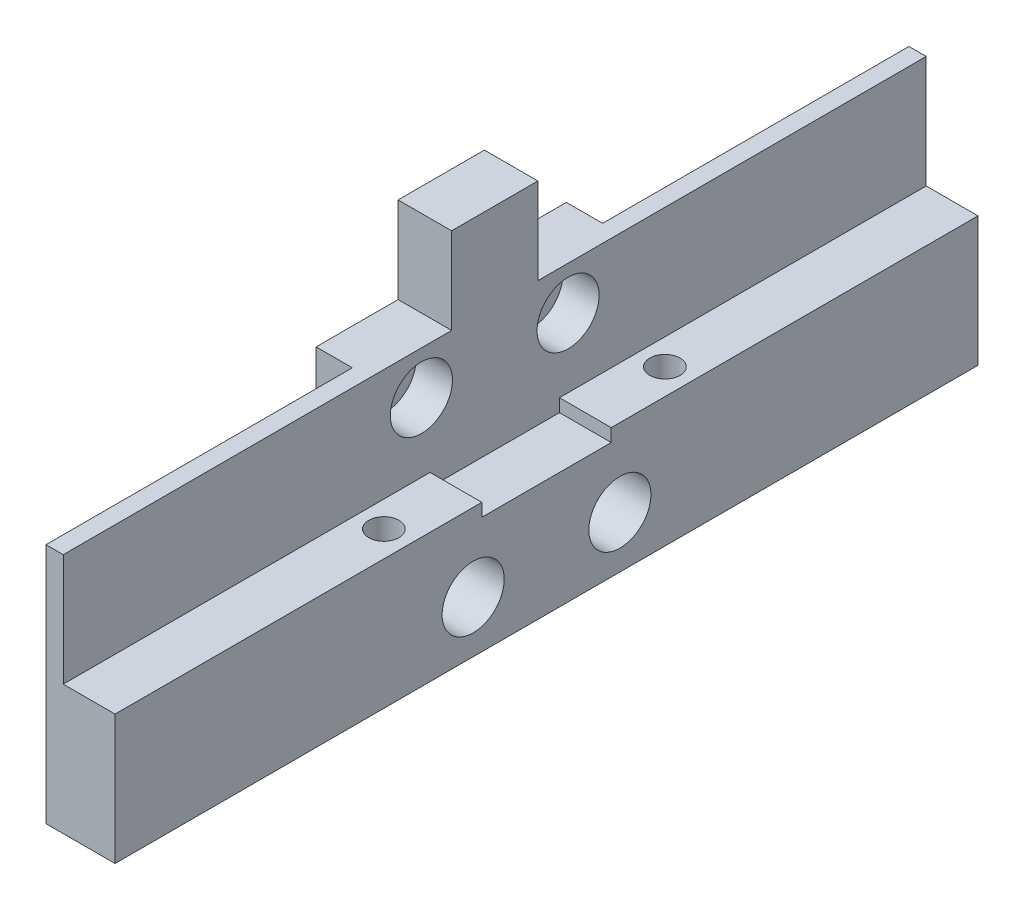
ISO-10303-21;
HEADER;
FILE_DESCRIPTION(('STEP AP214'),'2;1');
FILE_NAME('part.step','',(''),(''),'','','');
FILE_SCHEMA(('AUTOMOTIVE_DESIGN { 1 0 10303 214 1 1 1 1 }'));
ENDSEC;
DATA;
#1=APPLICATION_CONTEXT('core data for automotive mechanical design processes');
#2=APPLICATION_PROTOCOL_DEFINITION('international standard','automotive_design',2000,#1);
#3=PRODUCT_CONTEXT('',#1,'mechanical');
#4=PRODUCT('Part','Part','',(#3));
#5=PRODUCT_RELATED_PRODUCT_CATEGORY('part','',(#4));
#6=PRODUCT_DEFINITION_FORMATION('','',#4);
#7=PRODUCT_DEFINITION_CONTEXT('part definition',#1,'design');
#8=PRODUCT_DEFINITION('design','',#6,#7);
#9=PRODUCT_DEFINITION_SHAPE('','',#8);
#10=(LENGTH_UNIT() NAMED_UNIT(*) SI_UNIT(.MILLI.,.METRE.));
#11=(NAMED_UNIT(*) PLANE_ANGLE_UNIT() SI_UNIT($,.RADIAN.));
#12=(NAMED_UNIT(*) SI_UNIT($,.STERADIAN.) SOLID_ANGLE_UNIT());
#13=UNCERTAINTY_MEASURE_WITH_UNIT(LENGTH_MEASURE(1.E-05),#10,'distance_accuracy_value','');
#14=(GEOMETRIC_REPRESENTATION_CONTEXT(3) GLOBAL_UNCERTAINTY_ASSIGNED_CONTEXT((#13)) GLOBAL_UNIT_ASSIGNED_CONTEXT((#10,
#11,#12)) REPRESENTATION_CONTEXT('',''));
#15=CARTESIAN_POINT('',(0.,0.,0.));
#16=DIRECTION('',(0.,0.,1.));
#17=DIRECTION('',(1.,0.,0.));
#18=AXIS2_PLACEMENT_3D('',#15,#16,#17);
#19=CARTESIAN_POINT('',(6.,26.,-100.));
#20=DIRECTION('',(0.,1.,0.));
#21=DIRECTION('',(0.,0.,1.));
#22=AXIS2_PLACEMENT_3D('',#19,#20,#21);
#23=PLANE('',#22);
#24=DIRECTION('',(0.,0.,-1.));
#25=VECTOR('',#24,1.);
#26=CARTESIAN_POINT('',(14.2,26.,0.));
#27=LINE('',#26,#25);
#28=CARTESIAN_POINT('',(14.2,26.,0.));
#29=VERTEX_POINT('',#28);
#30=CARTESIAN_POINT('',(14.2,26.,-35.5));
#31=VERTEX_POINT('',#30);
#32=EDGE_CURVE('E231',#29,#31,#27,.T.);
#33=ORIENTED_EDGE('',*,*,#32,.F.);
#34=DIRECTION('',(1.,0.,0.));
#35=VECTOR('',#34,1.);
#36=CARTESIAN_POINT('',(6.,26.,0.));
#37=LINE('',#36,#35);
#38=CARTESIAN_POINT('',(16.2,26.,0.));
#39=VERTEX_POINT('',#38);
#40=EDGE_CURVE('E190',#29,#39,#37,.T.);
#41=ORIENTED_EDGE('',*,*,#40,.T.);
#42=DIRECTION('',(0.,0.,1.));
#43=VECTOR('',#42,1.);
#44=CARTESIAN_POINT('',(16.2,26.,-100.));
#45=LINE('',#44,#43);
#46=CARTESIAN_POINT('',(16.2,26.,-45.));
#47=VERTEX_POINT('',#46);
#48=EDGE_CURVE('E179',#47,#39,#45,.T.);
#49=ORIENTED_EDGE('',*,*,#48,.F.);
#50=DIRECTION('',(-1.,0.,0.));
#51=VECTOR('',#50,1.);
#52=CARTESIAN_POINT('',(30.3421356237309,26.,-45.));
#53=LINE('',#52,#51);
#54=CARTESIAN_POINT('',(10.,26.,-45.));
#55=VERTEX_POINT('',#54);
#56=EDGE_CURVE('E255',#47,#55,#53,.T.);
#57=ORIENTED_EDGE('',*,*,#56,.T.);
#58=DIRECTION('',(0.,0.,1.));
#59=VECTOR('',#58,1.);
#60=CARTESIAN_POINT('',(10.,26.,0.));
#61=LINE('',#60,#59);
#62=CARTESIAN_POINT('',(10.,26.,-35.5));
#63=VERTEX_POINT('',#62);
#64=EDGE_CURVE('E194',#55,#63,#61,.T.);
#65=ORIENTED_EDGE('',*,*,#64,.T.);
#66=DIRECTION('',(-1.,0.,0.));
#67=VECTOR('',#66,1.);
#68=CARTESIAN_POINT('',(14.2,26.,-35.5));
#69=LINE('',#68,#67);
#70=EDGE_CURVE('E230',#31,#63,#69,.T.);
#71=ORIENTED_EDGE('',*,*,#70,.F.);
#72=EDGE_LOOP('',(#33,#41,#49,#57,#65,#71));
#73=FACE_BOUND('',#72,.T.);
#74=ADVANCED_FACE('F36',(#73),#23,.T.);
#75=CARTESIAN_POINT('',(12.,0.,0.));
#76=DIRECTION('',(1.,0.,0.));
#77=DIRECTION('',(0.,0.,1.));
#78=AXIS2_PLACEMENT_3D('',#75,#76,#77);
#79=PLANE('',#78);
#80=CARTESIAN_POINT('',(12.,21.,-41.5));
#81=DIRECTION('',(-1.,0.,0.));
#82=DIRECTION('',(0.,0.,1.));
#83=AXIS2_PLACEMENT_3D('',#80,#81,#82);
#84=CIRCLE('',#83,2.1);
#85=CARTESIAN_POINT('',(12.,21.,-39.4));
#86=VERTEX_POINT('',#85);
#87=EDGE_CURVE('E198',#86,#86,#84,.T.);
#88=ORIENTED_EDGE('',*,*,#87,.T.);
#89=EDGE_LOOP('',(#88));
#90=FACE_BOUND('',#89,.T.);
#91=CARTESIAN_POINT('',(12.,21.,-41.5));
#92=DIRECTION('',(1.,0.,0.));
#93=DIRECTION('',(0.,0.,-1.));
#94=AXIS2_PLACEMENT_3D('',#91,#92,#93);
#95=CIRCLE('',#94,3.6);
#96=CARTESIAN_POINT('',(12.,21.,-45.1));
#97=VERTEX_POINT('',#96);
#98=EDGE_CURVE('E173',#97,#97,#95,.T.);
#99=ORIENTED_EDGE('',*,*,#98,.T.);
#100=EDGE_LOOP('',(#99));
#101=FACE_BOUND('',#100,.T.);
#102=ADVANCED_FACE('F311',(#90,#101),#79,.T.);
#103=CARTESIAN_POINT('',(12.,21.,-58.5));
#104=DIRECTION('',(-1.,0.,0.));
#105=DIRECTION('',(0.,0.,1.));
#106=AXIS2_PLACEMENT_3D('',#103,#104,#105);
#107=CIRCLE('',#106,2.1);
#108=CARTESIAN_POINT('',(12.,21.,-56.4));
#109=VERTEX_POINT('',#108);
#110=EDGE_CURVE('E201',#109,#109,#107,.T.);
#111=ORIENTED_EDGE('',*,*,#110,.T.);
#112=EDGE_LOOP('',(#111));
#113=FACE_BOUND('',#112,.T.);
#114=CARTESIAN_POINT('',(12.,21.,-58.5));
#115=DIRECTION('',(1.,0.,0.));
#116=DIRECTION('',(0.,0.,-1.));
#117=AXIS2_PLACEMENT_3D('',#114,#115,#116);
#118=CIRCLE('',#117,3.6);
#119=CARTESIAN_POINT('',(12.,21.,-62.1));
#120=VERTEX_POINT('',#119);
#121=EDGE_CURVE('E169',#120,#120,#118,.T.);
#122=ORIENTED_EDGE('',*,*,#121,.T.);
#123=EDGE_LOOP('',(#122));
#124=FACE_BOUND('',#123,.T.);
#125=ADVANCED_FACE('F317',(#113,#124),#79,.T.);
#126=CARTESIAN_POINT('',(12.,4.,-58.5));
#127=DIRECTION('',(-1.,0.,0.));
#128=DIRECTION('',(0.,0.,1.));
#129=AXIS2_PLACEMENT_3D('',#126,#127,#128);
#130=CIRCLE('',#129,2.1);
#131=CARTESIAN_POINT('',(12.,4.,-56.4));
#132=VERTEX_POINT('',#131);
#133=EDGE_CURVE('E46',#132,#132,#130,.T.);
#134=ORIENTED_EDGE('',*,*,#133,.T.);
#135=EDGE_LOOP('',(#134));
#136=FACE_BOUND('',#135,.T.);
#137=CARTESIAN_POINT('',(12.,4.,-58.5));
#138=DIRECTION('',(1.,0.,0.));
#139=DIRECTION('',(0.,0.,-1.));
#140=AXIS2_PLACEMENT_3D('',#137,#138,#139);
#141=CIRCLE('',#140,3.6);
#142=CARTESIAN_POINT('',(12.,4.,-62.1));
#143=VERTEX_POINT('',#142);
#144=EDGE_CURVE('E166',#143,#143,#141,.T.);
#145=ORIENTED_EDGE('',*,*,#144,.T.);
#146=EDGE_LOOP('',(#145));
#147=FACE_BOUND('',#146,.T.);
#148=ADVANCED_FACE('F338',(#136,#147),#79,.T.);
#149=CARTESIAN_POINT('',(12.,4.,-41.5));
#150=DIRECTION('',(-1.,0.,0.));
#151=DIRECTION('',(0.,0.,1.));
#152=AXIS2_PLACEMENT_3D('',#149,#150,#151);
#153=CIRCLE('',#152,2.1);
#154=CARTESIAN_POINT('',(12.,4.,-39.4));
#155=VERTEX_POINT('',#154);
#156=EDGE_CURVE('E12',#155,#155,#153,.T.);
#157=ORIENTED_EDGE('',*,*,#156,.T.);
#158=EDGE_LOOP('',(#157));
#159=FACE_BOUND('',#158,.T.);
#160=CARTESIAN_POINT('',(12.,4.,-41.5));
#161=DIRECTION('',(1.,0.,0.));
#162=DIRECTION('',(0.,0.,-1.));
#163=AXIS2_PLACEMENT_3D('',#160,#161,#162);
#164=CIRCLE('',#163,3.6);
#165=CARTESIAN_POINT('',(12.,4.,-45.1));
#166=VERTEX_POINT('',#165);
#167=EDGE_CURVE('E163',#166,#166,#164,.T.);
#168=ORIENTED_EDGE('',*,*,#167,.T.);
#169=EDGE_LOOP('',(#168));
#170=FACE_BOUND('',#169,.T.);
#171=ADVANCED_FACE('F319',(#159,#170),#79,.T.);
#172=CARTESIAN_POINT('',(24.,21.,-41.5));
#173=DIRECTION('',(-1.,0.,0.));
#174=DIRECTION('',(0.,0.,-1.));
#175=AXIS2_PLACEMENT_3D('',#172,#173,#174);
#176=CYLINDRICAL_SURFACE('',#175,2.1);
#177=CARTESIAN_POINT('',(10.,21.,-41.5));
#178=DIRECTION('',(1.,0.,0.));
#179=DIRECTION('',(0.,0.,-1.));
#180=AXIS2_PLACEMENT_3D('',#177,#178,#179);
#181=CIRCLE('',#180,2.1);
#182=CARTESIAN_POINT('',(10.,21.,-43.6));
#183=VERTEX_POINT('',#182);
#184=EDGE_CURVE('E223',#183,#183,#181,.F.);
#185=ORIENTED_EDGE('',*,*,#184,.T.);
#186=EDGE_LOOP('',(#185));
#187=FACE_BOUND('',#186,.T.);
#188=ORIENTED_EDGE('',*,*,#87,.F.);
#189=EDGE_LOOP('',(#188));
#190=FACE_BOUND('',#189,.T.);
#191=ADVANCED_FACE('F289',(#187,#190),#176,.F.);
#192=CARTESIAN_POINT('',(24.,21.,-58.5));
#193=DIRECTION('',(-1.,0.,0.));
#194=DIRECTION('',(0.,0.,-1.));
#195=AXIS2_PLACEMENT_3D('',#192,#193,#194);
#196=CYLINDRICAL_SURFACE('',#195,2.1);
#197=CARTESIAN_POINT('',(10.,21.,-58.5));
#198=DIRECTION('',(1.,0.,0.));
#199=DIRECTION('',(0.,0.,-1.));
#200=AXIS2_PLACEMENT_3D('',#197,#198,#199);
#201=CIRCLE('',#200,2.1);
#202=CARTESIAN_POINT('',(10.,21.,-60.6));
#203=VERTEX_POINT('',#202);
#204=EDGE_CURVE('E284',#203,#203,#201,.F.);
#205=ORIENTED_EDGE('',*,*,#204,.T.);
#206=EDGE_LOOP('',(#205));
#207=FACE_BOUND('',#206,.T.);
#208=ORIENTED_EDGE('',*,*,#110,.F.);
#209=EDGE_LOOP('',(#208));
#210=FACE_BOUND('',#209,.T.);
#211=ADVANCED_FACE('F323',(#207,#210),#196,.F.);
#212=CARTESIAN_POINT('',(24.,4.,-58.5));
#213=DIRECTION('',(-1.,0.,0.));
#214=DIRECTION('',(0.,0.,-1.));
#215=AXIS2_PLACEMENT_3D('',#212,#213,#214);
#216=CYLINDRICAL_SURFACE('',#215,2.1);
#217=CARTESIAN_POINT('',(10.,4.,-58.5));
#218=DIRECTION('',(1.,0.,0.));
#219=DIRECTION('',(0.,0.,-1.));
#220=AXIS2_PLACEMENT_3D('',#217,#218,#219);
#221=CIRCLE('',#220,2.1);
#222=CARTESIAN_POINT('',(10.,4.,-60.6));
#223=VERTEX_POINT('',#222);
#224=EDGE_CURVE('E281',#223,#223,#221,.F.);
#225=ORIENTED_EDGE('',*,*,#224,.T.);
#226=EDGE_LOOP('',(#225));
#227=FACE_BOUND('',#226,.T.);
#228=ORIENTED_EDGE('',*,*,#133,.F.);
#229=EDGE_LOOP('',(#228));
#230=FACE_BOUND('',#229,.T.);
#231=ADVANCED_FACE('F326',(#227,#230),#216,.F.);
#232=CARTESIAN_POINT('',(24.,4.,-41.5));
#233=DIRECTION('',(-1.,0.,0.));
#234=DIRECTION('',(0.,0.,-1.));
#235=AXIS2_PLACEMENT_3D('',#232,#233,#234);
#236=CYLINDRICAL_SURFACE('',#235,2.1);
#237=CARTESIAN_POINT('',(10.,4.,-41.5));
#238=DIRECTION('',(1.,0.,0.));
#239=DIRECTION('',(0.,0.,-1.));
#240=AXIS2_PLACEMENT_3D('',#237,#238,#239);
#241=CIRCLE('',#240,2.1);
#242=CARTESIAN_POINT('',(10.,4.,-43.6));
#243=VERTEX_POINT('',#242);
#244=EDGE_CURVE('E278',#243,#243,#241,.F.);
#245=ORIENTED_EDGE('',*,*,#244,.T.);
#246=EDGE_LOOP('',(#245));
#247=FACE_BOUND('',#246,.T.);
#248=ORIENTED_EDGE('',*,*,#156,.F.);
#249=EDGE_LOOP('',(#248));
#250=FACE_BOUND('',#249,.T.);
#251=ADVANCED_FACE('F330',(#247,#250),#236,.F.);
#252=CARTESIAN_POINT('',(10.,0.,-100.));
#253=DIRECTION('',(0.,0.,1.));
#254=DIRECTION('',(-1.,0.,0.));
#255=AXIS2_PLACEMENT_3D('',#252,#253,#254);
#256=PLANE('',#255);
#257=DIRECTION('',(0.,1.,0.));
#258=VECTOR('',#257,1.);
#259=CARTESIAN_POINT('',(16.2,0.,-100.));
#260=LINE('',#259,#258);
#261=CARTESIAN_POINT('',(16.2,13.,-100.));
#262=VERTEX_POINT('',#261);
#263=CARTESIAN_POINT('',(16.2,26.,-100.));
#264=VERTEX_POINT('',#263);
#265=EDGE_CURVE('E188',#262,#264,#260,.T.);
#266=ORIENTED_EDGE('',*,*,#265,.F.);
#267=DIRECTION('',(1.,0.,0.));
#268=VECTOR('',#267,1.);
#269=CARTESIAN_POINT('',(-84.6414597276339,13.,-100.));
#270=LINE('',#269,#268);
#271=CARTESIAN_POINT('',(22.2,13.,-100.));
#272=VERTEX_POINT('',#271);
#273=EDGE_CURVE('E157',#262,#272,#270,.T.);
#274=ORIENTED_EDGE('',*,*,#273,.T.);
#275=DIRECTION('',(0.,1.,0.));
#276=VECTOR('',#275,1.);
#277=CARTESIAN_POINT('',(22.2,0.,-100.));
#278=LINE('',#277,#276);
#279=CARTESIAN_POINT('',(22.2,-2.,-100.));
#280=VERTEX_POINT('',#279);
#281=EDGE_CURVE('E141',#280,#272,#278,.T.);
#282=ORIENTED_EDGE('',*,*,#281,.F.);
#283=DIRECTION('',(1.,0.,0.));
#284=VECTOR('',#283,1.);
#285=CARTESIAN_POINT('',(-94.0799680255744,-2.,-100.));
#286=LINE('',#285,#284);
#287=CARTESIAN_POINT('',(14.2,-2.,-100.));
#288=VERTEX_POINT('',#287);
#289=EDGE_CURVE('E131',#288,#280,#286,.T.);
#290=ORIENTED_EDGE('',*,*,#289,.F.);
#291=DIRECTION('',(0.,1.,0.));
#292=VECTOR('',#291,1.);
#293=CARTESIAN_POINT('',(14.2,-4.,-100.));
#294=LINE('',#293,#292);
#295=CARTESIAN_POINT('',(14.2,26.,-100.));
#296=VERTEX_POINT('',#295);
#297=EDGE_CURVE('E236',#288,#296,#294,.T.);
#298=ORIENTED_EDGE('',*,*,#297,.T.);
#299=DIRECTION('',(1.,0.,0.));
#300=VECTOR('',#299,1.);
#301=CARTESIAN_POINT('',(6.,26.,-100.));
#302=LINE('',#301,#300);
#303=EDGE_CURVE('E191',#296,#264,#302,.T.);
#304=ORIENTED_EDGE('',*,*,#303,.T.);
#305=EDGE_LOOP('',(#266,#274,#282,#290,#298,#304));
#306=FACE_BOUND('',#305,.T.);
#307=ADVANCED_FACE('F155',(#306),#256,.F.);
#308=CARTESIAN_POINT('',(10.,0.,0.));
#309=DIRECTION('',(0.,0.,-1.));
#310=DIRECTION('',(1.,0.,0.));
#311=AXIS2_PLACEMENT_3D('',#308,#309,#310);
#312=PLANE('',#311);
#313=DIRECTION('',(1.,0.,0.));
#314=VECTOR('',#313,1.);
#315=CARTESIAN_POINT('',(-84.6414597276339,13.,0.));
#316=LINE('',#315,#314);
#317=CARTESIAN_POINT('',(16.2,13.,0.));
#318=VERTEX_POINT('',#317);
#319=CARTESIAN_POINT('',(22.2,13.,0.));
#320=VERTEX_POINT('',#319);
#321=EDGE_CURVE('E705',#318,#320,#316,.T.);
#322=ORIENTED_EDGE('',*,*,#321,.F.);
#323=DIRECTION('',(0.,-1.,0.));
#324=VECTOR('',#323,1.);
#325=CARTESIAN_POINT('',(16.2,26.,0.));
#326=LINE('',#325,#324);
#327=EDGE_CURVE('E185',#39,#318,#326,.T.);
#328=ORIENTED_EDGE('',*,*,#327,.F.);
#329=ORIENTED_EDGE('',*,*,#40,.F.);
#330=DIRECTION('',(0.,1.,0.));
#331=VECTOR('',#330,1.);
#332=CARTESIAN_POINT('',(14.2,-4.,0.));
#333=LINE('',#332,#331);
#334=CARTESIAN_POINT('',(14.2,-2.,0.));
#335=VERTEX_POINT('',#334);
#336=EDGE_CURVE('E81',#335,#29,#333,.T.);
#337=ORIENTED_EDGE('',*,*,#336,.F.);
#338=DIRECTION('',(1.,0.,0.));
#339=VECTOR('',#338,1.);
#340=CARTESIAN_POINT('',(10.,-2.,0.));
#341=LINE('',#340,#339);
#342=CARTESIAN_POINT('',(22.2,-2.,0.));
#343=VERTEX_POINT('',#342);
#344=EDGE_CURVE('E140',#335,#343,#341,.T.);
#345=ORIENTED_EDGE('',*,*,#344,.T.);
#346=DIRECTION('',(0.,-1.,0.));
#347=VECTOR('',#346,1.);
#348=CARTESIAN_POINT('',(22.2,0.,0.));
#349=LINE('',#348,#347);
#350=EDGE_CURVE('E152',#320,#343,#349,.T.);
#351=ORIENTED_EDGE('',*,*,#350,.F.);
#352=EDGE_LOOP('',(#322,#328,#329,#337,#345,#351));
#353=FACE_BOUND('',#352,.T.);
#354=ADVANCED_FACE('F295',(#353),#312,.F.);
#355=CARTESIAN_POINT('',(10.,0.,0.));
#356=DIRECTION('',(1.,0.,0.));
#357=DIRECTION('',(0.,0.,1.));
#358=AXIS2_PLACEMENT_3D('',#355,#356,#357);
#359=PLANE('',#358);
#360=DIRECTION('',(0.,0.,-1.));
#361=VECTOR('',#360,1.);
#362=CARTESIAN_POINT('',(9.99999999999999,-2.,-100.));
#363=LINE('',#362,#361);
#364=CARTESIAN_POINT('',(10.,-2.,-35.5));
#365=VERTEX_POINT('',#364);
#366=CARTESIAN_POINT('',(10.,-2.,-64.5));
#367=VERTEX_POINT('',#366);
#368=EDGE_CURVE('E221',#365,#367,#363,.T.);
#369=ORIENTED_EDGE('',*,*,#368,.F.);
#370=DIRECTION('',(0.,1.,0.));
#371=VECTOR('',#370,1.);
#372=CARTESIAN_POINT('',(10.,-4.,-35.5));
#373=LINE('',#372,#371);
#374=EDGE_CURVE('E228',#365,#63,#373,.T.);
#375=ORIENTED_EDGE('',*,*,#374,.T.);
#376=ORIENTED_EDGE('',*,*,#64,.F.);
#377=DIRECTION('',(0.,1.,0.));
#378=VECTOR('',#377,1.);
#379=CARTESIAN_POINT('',(10.,26.,-45.));
#380=LINE('',#379,#378);
#381=CARTESIAN_POINT('',(10.,36.,-45.));
#382=VERTEX_POINT('',#381);
#383=EDGE_CURVE('E256',#55,#382,#380,.T.);
#384=ORIENTED_EDGE('',*,*,#383,.T.);
#385=DIRECTION('',(0.,0.,-1.));
#386=VECTOR('',#385,1.);
#387=CARTESIAN_POINT('',(10.,36.,-55.));
#388=LINE('',#387,#386);
#389=CARTESIAN_POINT('',(10.,36.,-55.));
#390=VERTEX_POINT('',#389);
#391=EDGE_CURVE('E252',#382,#390,#388,.T.);
#392=ORIENTED_EDGE('',*,*,#391,.T.);
#393=DIRECTION('',(0.,-1.,0.));
#394=VECTOR('',#393,1.);
#395=CARTESIAN_POINT('',(10.,26.,-55.));
#396=LINE('',#395,#394);
#397=CARTESIAN_POINT('',(10.,26.,-55.));
#398=VERTEX_POINT('',#397);
#399=EDGE_CURVE('E241',#390,#398,#396,.T.);
#400=ORIENTED_EDGE('',*,*,#399,.T.);
#401=CARTESIAN_POINT('',(10.,26.,-64.5));
#402=VERTEX_POINT('',#401);
#403=EDGE_CURVE('E196',#402,#398,#61,.T.);
#404=ORIENTED_EDGE('',*,*,#403,.F.);
#405=DIRECTION('',(0.,1.,0.));
#406=VECTOR('',#405,1.);
#407=CARTESIAN_POINT('',(10.,-4.,-64.5));
#408=LINE('',#407,#406);
#409=EDGE_CURVE('E217',#367,#402,#408,.T.);
#410=ORIENTED_EDGE('',*,*,#409,.F.);
#411=EDGE_LOOP('',(#369,#375,#376,#384,#392,#400,#404,#410));
#412=FACE_BOUND('',#411,.T.);
#413=ORIENTED_EDGE('',*,*,#204,.F.);
#414=EDGE_LOOP('',(#413));
#415=FACE_BOUND('',#414,.T.);
#416=ORIENTED_EDGE('',*,*,#244,.F.);
#417=EDGE_LOOP('',(#416));
#418=FACE_BOUND('',#417,.T.);
#419=ORIENTED_EDGE('',*,*,#224,.F.);
#420=EDGE_LOOP('',(#419));
#421=FACE_BOUND('',#420,.T.);
#422=ORIENTED_EDGE('',*,*,#184,.F.);
#423=EDGE_LOOP('',(#422));
#424=FACE_BOUND('',#423,.T.);
#425=ADVANCED_FACE('F292',(#412,#415,#418,#421,#424),#359,.F.);
#426=DIRECTION('',(0.,0.,-1.));
#427=VECTOR('',#426,1.);
#428=CARTESIAN_POINT('',(14.2,26.,-100.));
#429=LINE('',#428,#427);
#430=CARTESIAN_POINT('',(14.2,26.,-64.5));
#431=VERTEX_POINT('',#430);
#432=EDGE_CURVE('E220',#431,#296,#429,.T.);
#433=ORIENTED_EDGE('',*,*,#432,.F.);
#434=DIRECTION('',(1.,0.,0.));
#435=VECTOR('',#434,1.);
#436=CARTESIAN_POINT('',(10.,26.,-64.5));
#437=LINE('',#436,#435);
#438=EDGE_CURVE('E243',#402,#431,#437,.T.);
#439=ORIENTED_EDGE('',*,*,#438,.F.);
#440=ORIENTED_EDGE('',*,*,#403,.T.);
#441=DIRECTION('',(-1.,0.,0.));
#442=VECTOR('',#441,1.);
#443=CARTESIAN_POINT('',(30.3421356237309,26.,-55.));
#444=LINE('',#443,#442);
#445=CARTESIAN_POINT('',(16.2,26.,-55.));
#446=VERTEX_POINT('',#445);
#447=EDGE_CURVE('E263',#446,#398,#444,.T.);
#448=ORIENTED_EDGE('',*,*,#447,.F.);
#449=EDGE_CURVE('E182',#264,#446,#45,.T.);
#450=ORIENTED_EDGE('',*,*,#449,.F.);
#451=ORIENTED_EDGE('',*,*,#303,.F.);
#452=EDGE_LOOP('',(#433,#439,#440,#448,#450,#451));
#453=FACE_BOUND('',#452,.T.);
#454=ADVANCED_FACE('F294',(#453),#23,.T.);
#455=CARTESIAN_POINT('',(16.2,0.,0.));
#456=DIRECTION('',(1.,0.,0.));
#457=DIRECTION('',(0.,0.,-1.));
#458=AXIS2_PLACEMENT_3D('',#455,#456,#457);
#459=PLANE('',#458);
#460=DIRECTION('',(0.,0.,-1.));
#461=VECTOR('',#460,1.);
#462=CARTESIAN_POINT('',(16.2,13.,-57.5));
#463=LINE('',#462,#461);
#464=CARTESIAN_POINT('',(16.2,13.,-57.5));
#465=VERTEX_POINT('',#464);
#466=EDGE_CURVE('E701',#465,#262,#463,.T.);
#467=ORIENTED_EDGE('',*,*,#466,.T.);
#468=ORIENTED_EDGE('',*,*,#265,.T.);
#469=ORIENTED_EDGE('',*,*,#449,.T.);
#470=DIRECTION('',(0.,-1.,0.));
#471=VECTOR('',#470,1.);
#472=CARTESIAN_POINT('',(16.2,26.,-55.));
#473=LINE('',#472,#471);
#474=CARTESIAN_POINT('',(16.2,36.,-55.));
#475=VERTEX_POINT('',#474);
#476=EDGE_CURVE('E261',#475,#446,#473,.T.);
#477=ORIENTED_EDGE('',*,*,#476,.F.);
#478=DIRECTION('',(0.,0.,-1.));
#479=VECTOR('',#478,1.);
#480=CARTESIAN_POINT('',(16.2,36.,-55.));
#481=LINE('',#480,#479);
#482=CARTESIAN_POINT('',(16.2,36.,-45.));
#483=VERTEX_POINT('',#482);
#484=EDGE_CURVE('E265',#483,#475,#481,.T.);
#485=ORIENTED_EDGE('',*,*,#484,.F.);
#486=DIRECTION('',(0.,1.,0.));
#487=VECTOR('',#486,1.);
#488=CARTESIAN_POINT('',(16.2,26.,-45.));
#489=LINE('',#488,#487);
#490=EDGE_CURVE('E269',#47,#483,#489,.T.);
#491=ORIENTED_EDGE('',*,*,#490,.F.);
#492=ORIENTED_EDGE('',*,*,#48,.T.);
#493=ORIENTED_EDGE('',*,*,#327,.T.);
#494=DIRECTION('',(0.,0.,-1.));
#495=VECTOR('',#494,1.);
#496=CARTESIAN_POINT('',(16.2,13.,0.));
#497=LINE('',#496,#495);
#498=CARTESIAN_POINT('',(16.2,13.,-42.5));
#499=VERTEX_POINT('',#498);
#500=EDGE_CURVE('E246',#318,#499,#497,.T.);
#501=ORIENTED_EDGE('',*,*,#500,.T.);
#502=DIRECTION('',(0.,-1.,0.));
#503=VECTOR('',#502,1.);
#504=CARTESIAN_POINT('',(16.2,13.,-42.5));
#505=LINE('',#504,#503);
#506=CARTESIAN_POINT('',(16.2,11.5,-42.5));
#507=VERTEX_POINT('',#506);
#508=EDGE_CURVE('E711',#499,#507,#505,.T.);
#509=ORIENTED_EDGE('',*,*,#508,.T.);
#510=DIRECTION('',(0.,0.,-1.));
#511=VECTOR('',#510,1.);
#512=CARTESIAN_POINT('',(16.2,11.5,-42.5));
#513=LINE('',#512,#511);
#514=CARTESIAN_POINT('',(16.2,11.5,-57.5));
#515=VERTEX_POINT('',#514);
#516=EDGE_CURVE('E708',#507,#515,#513,.T.);
#517=ORIENTED_EDGE('',*,*,#516,.T.);
#518=DIRECTION('',(0.,1.,0.));
#519=VECTOR('',#518,1.);
#520=CARTESIAN_POINT('',(16.2,13.,-57.5));
#521=LINE('',#520,#519);
#522=EDGE_CURVE('E704',#515,#465,#521,.T.);
#523=ORIENTED_EDGE('',*,*,#522,.T.);
#524=EDGE_LOOP('',(#467,#468,#469,#477,#485,#491,#492,#493,#501,#509,#517,#523));
#525=FACE_BOUND('',#524,.T.);
#526=CARTESIAN_POINT('',(16.2,21.,-41.5));
#527=DIRECTION('',(1.,0.,0.));
#528=DIRECTION('',(0.,0.,-1.));
#529=AXIS2_PLACEMENT_3D('',#526,#527,#528);
#530=CIRCLE('',#529,3.6);
#531=CARTESIAN_POINT('',(16.2,21.,-45.1));
#532=VERTEX_POINT('',#531);
#533=EDGE_CURVE('E176',#532,#532,#530,.T.);
#534=ORIENTED_EDGE('',*,*,#533,.F.);
#535=EDGE_LOOP('',(#534));
#536=FACE_BOUND('',#535,.T.);
#537=CARTESIAN_POINT('',(16.2,21.,-58.5));
#538=DIRECTION('',(1.,0.,0.));
#539=DIRECTION('',(0.,0.,-1.));
#540=AXIS2_PLACEMENT_3D('',#537,#538,#539);
#541=CIRCLE('',#540,3.6);
#542=CARTESIAN_POINT('',(16.2,21.,-62.1));
#543=VERTEX_POINT('',#542);
#544=EDGE_CURVE('E170',#543,#543,#541,.T.);
#545=ORIENTED_EDGE('',*,*,#544,.F.);
#546=EDGE_LOOP('',(#545));
#547=FACE_BOUND('',#546,.T.);
#548=ADVANCED_FACE('F303',(#525,#536,#547),#459,.T.);
#549=CARTESIAN_POINT('',(16.2,21.,-41.5));
#550=DIRECTION('',(-1.,0.,0.));
#551=DIRECTION('',(0.,0.,1.));
#552=AXIS2_PLACEMENT_3D('',#549,#550,#551);
#553=CYLINDRICAL_SURFACE('',#552,3.6);
#554=ORIENTED_EDGE('',*,*,#533,.T.);
#555=EDGE_LOOP('',(#554));
#556=FACE_BOUND('',#555,.T.);
#557=ORIENTED_EDGE('',*,*,#98,.F.);
#558=EDGE_LOOP('',(#557));
#559=FACE_BOUND('',#558,.T.);
#560=ADVANCED_FACE('F479',(#556,#559),#553,.F.);
#561=CARTESIAN_POINT('',(16.2,21.,-58.5));
#562=DIRECTION('',(-1.,0.,0.));
#563=DIRECTION('',(0.,0.,1.));
#564=AXIS2_PLACEMENT_3D('',#561,#562,#563);
#565=CYLINDRICAL_SURFACE('',#564,3.6);
#566=ORIENTED_EDGE('',*,*,#544,.T.);
#567=EDGE_LOOP('',(#566));
#568=FACE_BOUND('',#567,.T.);
#569=ORIENTED_EDGE('',*,*,#121,.F.);
#570=EDGE_LOOP('',(#569));
#571=FACE_BOUND('',#570,.T.);
#572=ADVANCED_FACE('F371',(#568,#571),#565,.F.);
#573=CARTESIAN_POINT('',(16.2,4.,-58.5));
#574=DIRECTION('',(-1.,0.,0.));
#575=DIRECTION('',(0.,0.,1.));
#576=AXIS2_PLACEMENT_3D('',#573,#574,#575);
#577=CYLINDRICAL_SURFACE('',#576,3.6);
#578=ORIENTED_EDGE('',*,*,#144,.F.);
#579=EDGE_LOOP('',(#578));
#580=FACE_BOUND('',#579,.T.);
#581=CARTESIAN_POINT('',(22.2,4.,-58.5));
#582=DIRECTION('',(1.,0.,0.));
#583=DIRECTION('',(0.,0.,-1.));
#584=AXIS2_PLACEMENT_3D('',#581,#582,#583);
#585=CIRCLE('',#584,3.6);
#586=CARTESIAN_POINT('',(22.2,4.,-62.1));
#587=VERTEX_POINT('',#586);
#588=EDGE_CURVE('E209',#587,#587,#585,.T.);
#589=ORIENTED_EDGE('',*,*,#588,.T.);
#590=EDGE_LOOP('',(#589));
#591=FACE_BOUND('',#590,.T.);
#592=ADVANCED_FACE('F366',(#580,#591),#577,.F.);
#593=CARTESIAN_POINT('',(16.2,4.,-41.5));
#594=DIRECTION('',(-1.,0.,0.));
#595=DIRECTION('',(0.,0.,1.));
#596=AXIS2_PLACEMENT_3D('',#593,#594,#595);
#597=CYLINDRICAL_SURFACE('',#596,3.6);
#598=ORIENTED_EDGE('',*,*,#167,.F.);
#599=EDGE_LOOP('',(#598));
#600=FACE_BOUND('',#599,.T.);
#601=CARTESIAN_POINT('',(22.2,4.,-41.5));
#602=DIRECTION('',(1.,0.,0.));
#603=DIRECTION('',(0.,0.,-1.));
#604=AXIS2_PLACEMENT_3D('',#601,#602,#603);
#605=CIRCLE('',#604,3.6);
#606=CARTESIAN_POINT('',(22.2,4.,-45.1));
#607=VERTEX_POINT('',#606);
#608=EDGE_CURVE('E718',#607,#607,#605,.T.);
#609=ORIENTED_EDGE('',*,*,#608,.T.);
#610=EDGE_LOOP('',(#609));
#611=FACE_BOUND('',#610,.T.);
#612=ADVANCED_FACE('F370',(#600,#611),#597,.F.);
#613=CARTESIAN_POINT('',(-94.0799680255744,-2.,-100.));
#614=DIRECTION('',(0.,1.,0.));
#615=DIRECTION('',(0.,0.,1.));
#616=AXIS2_PLACEMENT_3D('',#613,#614,#615);
#617=PLANE('',#616);
#618=CARTESIAN_POINT('',(19.2,-2.,-34.15));
#619=DIRECTION('',(0.,1.,0.));
#620=DIRECTION('',(0.,0.,1.));
#621=AXIS2_PLACEMENT_3D('',#618,#619,#620);
#622=CIRCLE('',#621,1.75);
#623=CARTESIAN_POINT('',(19.2,-2.,-32.4));
#624=VERTEX_POINT('',#623);
#625=EDGE_CURVE('E206',#624,#624,#622,.T.);
#626=ORIENTED_EDGE('',*,*,#625,.T.);
#627=EDGE_LOOP('',(#626));
#628=FACE_BOUND('',#627,.T.);
#629=CARTESIAN_POINT('',(19.2,-2.,-66.7167905799001));
#630=DIRECTION('',(0.,1.,0.));
#631=DIRECTION('',(0.,0.,1.));
#632=AXIS2_PLACEMENT_3D('',#629,#630,#631);
#633=CIRCLE('',#632,1.75);
#634=CARTESIAN_POINT('',(19.2,-2.,-64.9667905799001));
#635=VERTEX_POINT('',#634);
#636=EDGE_CURVE('E211',#635,#635,#633,.T.);
#637=ORIENTED_EDGE('',*,*,#636,.T.);
#638=EDGE_LOOP('',(#637));
#639=FACE_BOUND('',#638,.T.);
#640=ORIENTED_EDGE('',*,*,#344,.F.);
#641=DIRECTION('',(0.,0.,-1.));
#642=VECTOR('',#641,1.);
#643=CARTESIAN_POINT('',(14.2,-2.,-100.));
#644=LINE('',#643,#642);
#645=CARTESIAN_POINT('',(14.2,-2.,-35.5));
#646=VERTEX_POINT('',#645);
#647=EDGE_CURVE('E40',#335,#646,#644,.T.);
#648=ORIENTED_EDGE('',*,*,#647,.T.);
#649=DIRECTION('',(-1.,0.,0.));
#650=VECTOR('',#649,1.);
#651=CARTESIAN_POINT('',(-94.0799680255744,-2.,-35.5));
#652=LINE('',#651,#650);
#653=EDGE_CURVE('E224',#646,#365,#652,.T.);
#654=ORIENTED_EDGE('',*,*,#653,.T.);
#655=ORIENTED_EDGE('',*,*,#368,.T.);
#656=DIRECTION('',(1.,0.,0.));
#657=VECTOR('',#656,1.);
#658=CARTESIAN_POINT('',(-94.0799680255744,-2.,-64.5));
#659=LINE('',#658,#657);
#660=CARTESIAN_POINT('',(14.2,-2.,-64.5));
#661=VERTEX_POINT('',#660);
#662=EDGE_CURVE('E218',#367,#661,#659,.T.);
#663=ORIENTED_EDGE('',*,*,#662,.T.);
#664=DIRECTION('',(0.,0.,-1.));
#665=VECTOR('',#664,1.);
#666=CARTESIAN_POINT('',(14.2,-2.,-100.));
#667=LINE('',#666,#665);
#668=EDGE_CURVE('E55',#661,#288,#667,.T.);
#669=ORIENTED_EDGE('',*,*,#668,.T.);
#670=ORIENTED_EDGE('',*,*,#289,.T.);
#671=DIRECTION('',(0.,0.,-1.));
#672=VECTOR('',#671,1.);
#673=CARTESIAN_POINT('',(22.2,-2.,-100.));
#674=LINE('',#673,#672);
#675=EDGE_CURVE('E134',#343,#280,#674,.T.);
#676=ORIENTED_EDGE('',*,*,#675,.F.);
#677=EDGE_LOOP('',(#640,#648,#654,#655,#663,#669,#670,#676));
#678=FACE_BOUND('',#677,.T.);
#679=ADVANCED_FACE('F38',(#628,#639,#678),#617,.F.);
#680=CARTESIAN_POINT('',(22.2,0.,0.));
#681=DIRECTION('',(1.,0.,0.));
#682=DIRECTION('',(0.,0.,-1.));
#683=AXIS2_PLACEMENT_3D('',#680,#681,#682);
#684=PLANE('',#683);
#685=ORIENTED_EDGE('',*,*,#350,.T.);
#686=ORIENTED_EDGE('',*,*,#675,.T.);
#687=ORIENTED_EDGE('',*,*,#281,.T.);
#688=DIRECTION('',(0.,0.,1.));
#689=VECTOR('',#688,1.);
#690=CARTESIAN_POINT('',(22.2,13.,-57.5));
#691=LINE('',#690,#689);
#692=CARTESIAN_POINT('',(22.2,13.,-57.5));
#693=VERTEX_POINT('',#692);
#694=EDGE_CURVE('E721',#272,#693,#691,.T.);
#695=ORIENTED_EDGE('',*,*,#694,.T.);
#696=DIRECTION('',(0.,-1.,0.));
#697=VECTOR('',#696,1.);
#698=CARTESIAN_POINT('',(22.2,13.,-57.5));
#699=LINE('',#698,#697);
#700=CARTESIAN_POINT('',(22.2,11.5,-57.5));
#701=VERTEX_POINT('',#700);
#702=EDGE_CURVE('E723',#693,#701,#699,.T.);
#703=ORIENTED_EDGE('',*,*,#702,.T.);
#704=DIRECTION('',(0.,0.,1.));
#705=VECTOR('',#704,1.);
#706=CARTESIAN_POINT('',(22.2,11.5,-42.5));
#707=LINE('',#706,#705);
#708=CARTESIAN_POINT('',(22.2,11.5,-42.5));
#709=VERTEX_POINT('',#708);
#710=EDGE_CURVE('E726',#701,#709,#707,.T.);
#711=ORIENTED_EDGE('',*,*,#710,.T.);
#712=DIRECTION('',(0.,1.,0.));
#713=VECTOR('',#712,1.);
#714=CARTESIAN_POINT('',(22.2,13.,-42.5));
#715=LINE('',#714,#713);
#716=CARTESIAN_POINT('',(22.2,13.,-42.5));
#717=VERTEX_POINT('',#716);
#718=EDGE_CURVE('E729',#709,#717,#715,.T.);
#719=ORIENTED_EDGE('',*,*,#718,.T.);
#720=DIRECTION('',(0.,0.,1.));
#721=VECTOR('',#720,1.);
#722=CARTESIAN_POINT('',(22.2,13.,0.));
#723=LINE('',#722,#721);
#724=EDGE_CURVE('E732',#717,#320,#723,.T.);
#725=ORIENTED_EDGE('',*,*,#724,.T.);
#726=EDGE_LOOP('',(#685,#686,#687,#695,#703,#711,#719,#725));
#727=FACE_BOUND('',#726,.T.);
#728=ORIENTED_EDGE('',*,*,#588,.F.);
#729=EDGE_LOOP('',(#728));
#730=FACE_BOUND('',#729,.T.);
#731=ORIENTED_EDGE('',*,*,#608,.F.);
#732=EDGE_LOOP('',(#731));
#733=FACE_BOUND('',#732,.T.);
#734=ADVANCED_FACE('F145',(#727,#730,#733),#684,.T.);
#735=CARTESIAN_POINT('',(30.3421356237309,26.,-45.));
#736=DIRECTION('',(0.,0.,1.));
#737=DIRECTION('',(0.,-1.,0.));
#738=AXIS2_PLACEMENT_3D('',#735,#736,#737);
#739=PLANE('',#738);
#740=ORIENTED_EDGE('',*,*,#56,.F.);
#741=ORIENTED_EDGE('',*,*,#490,.T.);
#742=DIRECTION('',(-1.,0.,0.));
#743=VECTOR('',#742,1.);
#744=CARTESIAN_POINT('',(30.3421356237309,36.,-45.));
#745=LINE('',#744,#743);
#746=EDGE_CURVE('E268',#483,#382,#745,.T.);
#747=ORIENTED_EDGE('',*,*,#746,.T.);
#748=ORIENTED_EDGE('',*,*,#383,.F.);
#749=EDGE_LOOP('',(#740,#741,#747,#748));
#750=FACE_BOUND('',#749,.T.);
#751=ADVANCED_FACE('F388',(#750),#739,.T.);
#752=CARTESIAN_POINT('',(30.3421356237309,36.,-55.));
#753=DIRECTION('',(0.,1.,0.));
#754=DIRECTION('',(0.,0.,1.));
#755=AXIS2_PLACEMENT_3D('',#752,#753,#754);
#756=PLANE('',#755);
#757=ORIENTED_EDGE('',*,*,#746,.F.);
#758=ORIENTED_EDGE('',*,*,#484,.T.);
#759=DIRECTION('',(-1.,0.,0.));
#760=VECTOR('',#759,1.);
#761=CARTESIAN_POINT('',(30.3421356237309,36.,-55.));
#762=LINE('',#761,#760);
#763=EDGE_CURVE('E264',#475,#390,#762,.T.);
#764=ORIENTED_EDGE('',*,*,#763,.T.);
#765=ORIENTED_EDGE('',*,*,#391,.F.);
#766=EDGE_LOOP('',(#757,#758,#764,#765));
#767=FACE_BOUND('',#766,.T.);
#768=ADVANCED_FACE('F470',(#767),#756,.T.);
#769=CARTESIAN_POINT('',(30.3421356237309,26.,-55.));
#770=DIRECTION('',(0.,0.,-1.));
#771=DIRECTION('',(-1.,0.,0.));
#772=AXIS2_PLACEMENT_3D('',#769,#770,#771);
#773=PLANE('',#772);
#774=ORIENTED_EDGE('',*,*,#763,.F.);
#775=ORIENTED_EDGE('',*,*,#476,.T.);
#776=ORIENTED_EDGE('',*,*,#447,.T.);
#777=ORIENTED_EDGE('',*,*,#399,.F.);
#778=EDGE_LOOP('',(#774,#775,#776,#777));
#779=FACE_BOUND('',#778,.T.);
#780=ADVANCED_FACE('F464',(#779),#773,.T.);
#781=CARTESIAN_POINT('',(14.2,-4.,-100.));
#782=DIRECTION('',(1.,0.,0.));
#783=DIRECTION('',(0.,0.,-1.));
#784=AXIS2_PLACEMENT_3D('',#781,#782,#783);
#785=PLANE('',#784);
#786=ORIENTED_EDGE('',*,*,#432,.T.);
#787=ORIENTED_EDGE('',*,*,#297,.F.);
#788=ORIENTED_EDGE('',*,*,#668,.F.);
#789=DIRECTION('',(0.,1.,0.));
#790=VECTOR('',#789,1.);
#791=CARTESIAN_POINT('',(14.2,-4.,-64.5));
#792=LINE('',#791,#790);
#793=EDGE_CURVE('E249',#661,#431,#792,.T.);
#794=ORIENTED_EDGE('',*,*,#793,.T.);
#795=EDGE_LOOP('',(#786,#787,#788,#794));
#796=FACE_BOUND('',#795,.T.);
#797=ADVANCED_FACE('F462',(#796),#785,.F.);
#798=CARTESIAN_POINT('',(10.,-4.,-64.5));
#799=DIRECTION('',(0.,0.,1.));
#800=DIRECTION('',(1.,0.,0.));
#801=AXIS2_PLACEMENT_3D('',#798,#799,#800);
#802=PLANE('',#801);
#803=ORIENTED_EDGE('',*,*,#438,.T.);
#804=ORIENTED_EDGE('',*,*,#793,.F.);
#805=ORIENTED_EDGE('',*,*,#662,.F.);
#806=ORIENTED_EDGE('',*,*,#409,.T.);
#807=EDGE_LOOP('',(#803,#804,#805,#806));
#808=FACE_BOUND('',#807,.T.);
#809=ADVANCED_FACE('F461',(#808),#802,.F.);
#810=CARTESIAN_POINT('',(14.2,-4.,0.));
#811=DIRECTION('',(1.,0.,0.));
#812=DIRECTION('',(0.,0.,-1.));
#813=AXIS2_PLACEMENT_3D('',#810,#811,#812);
#814=PLANE('',#813);
#815=ORIENTED_EDGE('',*,*,#32,.T.);
#816=DIRECTION('',(0.,1.,0.));
#817=VECTOR('',#816,1.);
#818=CARTESIAN_POINT('',(14.2,-4.,-35.5));
#819=LINE('',#818,#817);
#820=EDGE_CURVE('E74',#646,#31,#819,.T.);
#821=ORIENTED_EDGE('',*,*,#820,.F.);
#822=ORIENTED_EDGE('',*,*,#647,.F.);
#823=ORIENTED_EDGE('',*,*,#336,.T.);
#824=EDGE_LOOP('',(#815,#821,#822,#823));
#825=FACE_BOUND('',#824,.T.);
#826=ADVANCED_FACE('F458',(#825),#814,.F.);
#827=CARTESIAN_POINT('',(14.2,-4.,-35.5));
#828=DIRECTION('',(0.,0.,-1.));
#829=DIRECTION('',(-1.,0.,0.));
#830=AXIS2_PLACEMENT_3D('',#827,#828,#829);
#831=PLANE('',#830);
#832=ORIENTED_EDGE('',*,*,#70,.T.);
#833=ORIENTED_EDGE('',*,*,#374,.F.);
#834=ORIENTED_EDGE('',*,*,#653,.F.);
#835=ORIENTED_EDGE('',*,*,#820,.T.);
#836=EDGE_LOOP('',(#832,#833,#834,#835));
#837=FACE_BOUND('',#836,.T.);
#838=ADVANCED_FACE('F400',(#837),#831,.F.);
#839=CARTESIAN_POINT('',(-84.6414597276339,13.,-57.5));
#840=DIRECTION('',(0.,1.,0.));
#841=DIRECTION('',(0.,0.,1.));
#842=AXIS2_PLACEMENT_3D('',#839,#840,#841);
#843=PLANE('',#842);
#844=CARTESIAN_POINT('',(19.2,13.,-66.7167905799001));
#845=DIRECTION('',(0.,1.,0.));
#846=DIRECTION('',(0.,0.,1.));
#847=AXIS2_PLACEMENT_3D('',#844,#845,#846);
#848=CIRCLE('',#847,1.75);
#849=CARTESIAN_POINT('',(19.2,13.,-64.9667905799001));
#850=VERTEX_POINT('',#849);
#851=EDGE_CURVE('E214',#850,#850,#848,.T.);
#852=ORIENTED_EDGE('',*,*,#851,.F.);
#853=EDGE_LOOP('',(#852));
#854=FACE_BOUND('',#853,.T.);
#855=ORIENTED_EDGE('',*,*,#466,.F.);
#856=DIRECTION('',(1.,0.,0.));
#857=VECTOR('',#856,1.);
#858=CARTESIAN_POINT('',(-84.6414597276339,13.,-57.5));
#859=LINE('',#858,#857);
#860=EDGE_CURVE('E745',#465,#693,#859,.T.);
#861=ORIENTED_EDGE('',*,*,#860,.T.);
#862=ORIENTED_EDGE('',*,*,#694,.F.);
#863=ORIENTED_EDGE('',*,*,#273,.F.);
#864=EDGE_LOOP('',(#855,#861,#862,#863));
#865=FACE_BOUND('',#864,.T.);
#866=ADVANCED_FACE('F396',(#854,#865),#843,.T.);
#867=CARTESIAN_POINT('',(-84.6414597276339,13.,-57.5));
#868=DIRECTION('',(0.,0.,1.));
#869=DIRECTION('',(1.,0.,0.));
#870=AXIS2_PLACEMENT_3D('',#867,#868,#869);
#871=PLANE('',#870);
#872=ORIENTED_EDGE('',*,*,#522,.F.);
#873=DIRECTION('',(1.,0.,0.));
#874=VECTOR('',#873,1.);
#875=CARTESIAN_POINT('',(-84.6414597276339,11.5,-57.5));
#876=LINE('',#875,#874);
#877=EDGE_CURVE('E742',#515,#701,#876,.T.);
#878=ORIENTED_EDGE('',*,*,#877,.T.);
#879=ORIENTED_EDGE('',*,*,#702,.F.);
#880=ORIENTED_EDGE('',*,*,#860,.F.);
#881=EDGE_LOOP('',(#872,#878,#879,#880));
#882=FACE_BOUND('',#881,.T.);
#883=ADVANCED_FACE('F399',(#882),#871,.T.);
#884=CARTESIAN_POINT('',(-84.6414597276339,11.5,-42.5));
#885=DIRECTION('',(0.,1.,0.));
#886=DIRECTION('',(0.,0.,1.));
#887=AXIS2_PLACEMENT_3D('',#884,#885,#886);
#888=PLANE('',#887);
#889=ORIENTED_EDGE('',*,*,#516,.F.);
#890=DIRECTION('',(1.,0.,0.));
#891=VECTOR('',#890,1.);
#892=CARTESIAN_POINT('',(-84.6414597276339,11.5,-42.5));
#893=LINE('',#892,#891);
#894=EDGE_CURVE('E739',#507,#709,#893,.T.);
#895=ORIENTED_EDGE('',*,*,#894,.T.);
#896=ORIENTED_EDGE('',*,*,#710,.F.);
#897=ORIENTED_EDGE('',*,*,#877,.F.);
#898=EDGE_LOOP('',(#889,#895,#896,#897));
#899=FACE_BOUND('',#898,.T.);
#900=ADVANCED_FACE('F410',(#899),#888,.T.);
#901=CARTESIAN_POINT('',(-84.6414597276339,13.,-42.5));
#902=DIRECTION('',(0.,0.,-1.));
#903=DIRECTION('',(-1.,0.,0.));
#904=AXIS2_PLACEMENT_3D('',#901,#902,#903);
#905=PLANE('',#904);
#906=ORIENTED_EDGE('',*,*,#508,.F.);
#907=DIRECTION('',(1.,0.,0.));
#908=VECTOR('',#907,1.);
#909=CARTESIAN_POINT('',(-84.6414597276339,13.,-42.5));
#910=LINE('',#909,#908);
#911=EDGE_CURVE('E736',#499,#717,#910,.T.);
#912=ORIENTED_EDGE('',*,*,#911,.T.);
#913=ORIENTED_EDGE('',*,*,#718,.F.);
#914=ORIENTED_EDGE('',*,*,#894,.F.);
#915=EDGE_LOOP('',(#906,#912,#913,#914));
#916=FACE_BOUND('',#915,.T.);
#917=ADVANCED_FACE('F417',(#916),#905,.T.);
#918=CARTESIAN_POINT('',(-84.6414597276339,13.,0.));
#919=DIRECTION('',(0.,1.,0.));
#920=DIRECTION('',(0.,0.,1.));
#921=AXIS2_PLACEMENT_3D('',#918,#919,#920);
#922=PLANE('',#921);
#923=CARTESIAN_POINT('',(19.2,13.,-34.15));
#924=DIRECTION('',(0.,1.,0.));
#925=DIRECTION('',(0.,0.,1.));
#926=AXIS2_PLACEMENT_3D('',#923,#924,#925);
#927=CIRCLE('',#926,1.75);
#928=CARTESIAN_POINT('',(19.2,13.,-32.4));
#929=VERTEX_POINT('',#928);
#930=EDGE_CURVE('E210',#929,#929,#927,.T.);
#931=ORIENTED_EDGE('',*,*,#930,.F.);
#932=EDGE_LOOP('',(#931));
#933=FACE_BOUND('',#932,.T.);
#934=ORIENTED_EDGE('',*,*,#500,.F.);
#935=ORIENTED_EDGE('',*,*,#321,.T.);
#936=ORIENTED_EDGE('',*,*,#724,.F.);
#937=ORIENTED_EDGE('',*,*,#911,.F.);
#938=EDGE_LOOP('',(#934,#935,#936,#937));
#939=FACE_BOUND('',#938,.T.);
#940=ADVANCED_FACE('F354',(#933,#939),#922,.T.);
#941=CARTESIAN_POINT('',(19.2,-4.,-34.15));
#942=DIRECTION('',(0.,1.,0.));
#943=DIRECTION('',(0.,0.,1.));
#944=AXIS2_PLACEMENT_3D('',#941,#942,#943);
#945=CYLINDRICAL_SURFACE('',#944,1.75);
#946=ORIENTED_EDGE('',*,*,#625,.F.);
#947=EDGE_LOOP('',(#946));
#948=FACE_BOUND('',#947,.T.);
#949=ORIENTED_EDGE('',*,*,#930,.T.);
#950=EDGE_LOOP('',(#949));
#951=FACE_BOUND('',#950,.T.);
#952=ADVANCED_FACE('F430',(#948,#951),#945,.F.);
#953=CARTESIAN_POINT('',(19.2,-4.,-66.7167905799001));
#954=DIRECTION('',(0.,1.,0.));
#955=DIRECTION('',(0.,0.,1.));
#956=AXIS2_PLACEMENT_3D('',#953,#954,#955);
#957=CYLINDRICAL_SURFACE('',#956,1.75);
#958=ORIENTED_EDGE('',*,*,#636,.F.);
#959=EDGE_LOOP('',(#958));
#960=FACE_BOUND('',#959,.T.);
#961=ORIENTED_EDGE('',*,*,#851,.T.);
#962=EDGE_LOOP('',(#961));
#963=FACE_BOUND('',#962,.T.);
#964=ADVANCED_FACE('F439',(#960,#963),#957,.F.);
#965=CLOSED_SHELL('',(#74,#102,#125,#148,#171,#191,#211,#231,#251,#307,#354,#425,#454,#548,#560,
#572,#592,#612,#679,#734,#751,#768,#780,#797,#809,#826,#838,#866,#883,#900,#917,#940,#952,#964));
#966=MANIFOLD_SOLID_BREP('B2',#965);
#967=ADVANCED_BREP_SHAPE_REPRESENTATION('',(#18,#966),#14);
#968=SHAPE_DEFINITION_REPRESENTATION(#9,#967);
ENDSEC;
END-ISO-10303-21;
